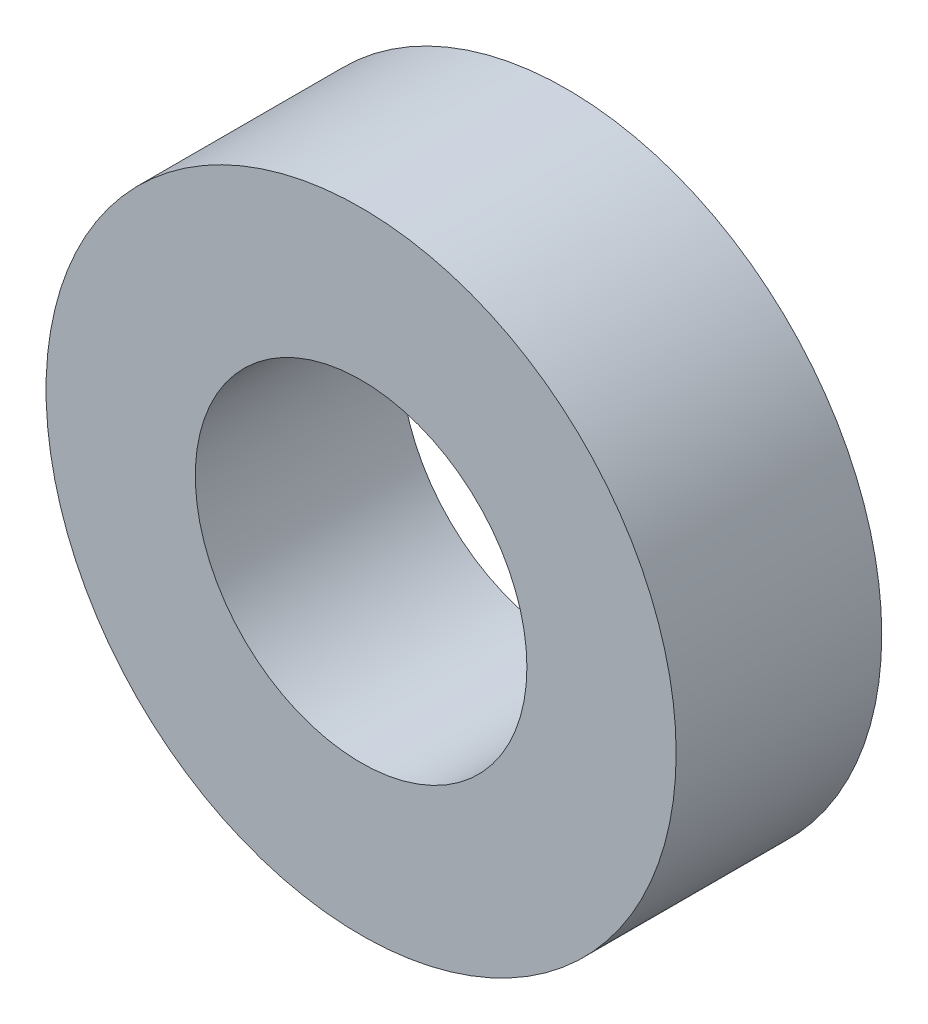
ISO-10303-21;
HEADER;
FILE_DESCRIPTION(('STEP AP214'),'2;1');
FILE_NAME('part.step','',(''),(''),'','','');
FILE_SCHEMA(('AUTOMOTIVE_DESIGN { 1 0 10303 214 1 1 1 1 }'));
ENDSEC;
DATA;
#1=APPLICATION_CONTEXT('core data for automotive mechanical design processes');
#2=APPLICATION_PROTOCOL_DEFINITION('international standard','automotive_design',2000,#1);
#3=PRODUCT_CONTEXT('',#1,'mechanical');
#4=PRODUCT('Part','Part','',(#3));
#5=PRODUCT_RELATED_PRODUCT_CATEGORY('part','',(#4));
#6=PRODUCT_DEFINITION_FORMATION('','',#4);
#7=PRODUCT_DEFINITION_CONTEXT('part definition',#1,'design');
#8=PRODUCT_DEFINITION('design','',#6,#7);
#9=PRODUCT_DEFINITION_SHAPE('','',#8);
#10=(LENGTH_UNIT() NAMED_UNIT(*) SI_UNIT(.MILLI.,.METRE.));
#11=(NAMED_UNIT(*) PLANE_ANGLE_UNIT() SI_UNIT($,.RADIAN.));
#12=(NAMED_UNIT(*) SI_UNIT($,.STERADIAN.) SOLID_ANGLE_UNIT());
#13=UNCERTAINTY_MEASURE_WITH_UNIT(LENGTH_MEASURE(1.E-05),#10,'distance_accuracy_value','');
#14=(GEOMETRIC_REPRESENTATION_CONTEXT(3) GLOBAL_UNCERTAINTY_ASSIGNED_CONTEXT((#13)) GLOBAL_UNIT_ASSIGNED_CONTEXT((#10,
#11,#12)) REPRESENTATION_CONTEXT('',''));
#15=CARTESIAN_POINT('',(0.,0.,0.));
#16=DIRECTION('',(0.,0.,1.));
#17=DIRECTION('',(1.,0.,0.));
#18=AXIS2_PLACEMENT_3D('',#15,#16,#17);
#19=CARTESIAN_POINT('',(0.,0.,-3.1));
#20=DIRECTION('',(0.,0.,1.));
#21=DIRECTION('',(1.,0.,0.));
#22=AXIS2_PLACEMENT_3D('',#19,#20,#21);
#23=CYLINDRICAL_SURFACE('',#22,4.75);
#24=CARTESIAN_POINT('',(0.,0.,-3.1));
#25=DIRECTION('',(0.,0.,1.));
#26=DIRECTION('',(1.,0.,0.));
#27=AXIS2_PLACEMENT_3D('',#24,#25,#26);
#28=CIRCLE('',#27,4.75);
#29=CARTESIAN_POINT('',(4.75,0.,-3.1));
#30=VERTEX_POINT('',#29);
#31=EDGE_CURVE('E10',#30,#30,#28,.T.);
#32=ORIENTED_EDGE('',*,*,#31,.T.);
#33=EDGE_LOOP('',(#32));
#34=FACE_BOUND('',#33,.T.);
#35=CARTESIAN_POINT('',(0.,0.,0.));
#36=DIRECTION('',(0.,0.,1.));
#37=DIRECTION('',(1.,0.,0.));
#38=AXIS2_PLACEMENT_3D('',#35,#36,#37);
#39=CIRCLE('',#38,4.75);
#40=CARTESIAN_POINT('',(4.75,0.,0.));
#41=VERTEX_POINT('',#40);
#42=EDGE_CURVE('E36',#41,#41,#39,.T.);
#43=ORIENTED_EDGE('',*,*,#42,.F.);
#44=EDGE_LOOP('',(#43));
#45=FACE_BOUND('',#44,.T.);
#46=ADVANCED_FACE('F33',(#34,#45),#23,.T.);
#47=CARTESIAN_POINT('',(0.,0.,-3.1));
#48=DIRECTION('',(0.,0.,1.));
#49=DIRECTION('',(1.,0.,0.));
#50=AXIS2_PLACEMENT_3D('',#47,#48,#49);
#51=PLANE('',#50);
#52=CARTESIAN_POINT('',(0.,0.,-3.1));
#53=DIRECTION('',(0.,0.,1.));
#54=DIRECTION('',(1.,0.,0.));
#55=AXIS2_PLACEMENT_3D('',#52,#53,#54);
#56=CIRCLE('',#55,2.5);
#57=CARTESIAN_POINT('',(2.5,0.,-3.1));
#58=VERTEX_POINT('',#57);
#59=EDGE_CURVE('E43',#58,#58,#56,.T.);
#60=ORIENTED_EDGE('',*,*,#59,.T.);
#61=EDGE_LOOP('',(#60));
#62=FACE_BOUND('',#61,.T.);
#63=ORIENTED_EDGE('',*,*,#31,.F.);
#64=EDGE_LOOP('',(#63));
#65=FACE_BOUND('',#64,.T.);
#66=ADVANCED_FACE('F51',(#62,#65),#51,.F.);
#67=CARTESIAN_POINT('',(0.,0.,0.));
#68=DIRECTION('',(0.,0.,1.));
#69=DIRECTION('',(1.,0.,0.));
#70=AXIS2_PLACEMENT_3D('',#67,#68,#69);
#71=PLANE('',#70);
#72=CARTESIAN_POINT('',(0.,0.,0.));
#73=DIRECTION('',(0.,0.,1.));
#74=DIRECTION('',(1.,0.,0.));
#75=AXIS2_PLACEMENT_3D('',#72,#73,#74);
#76=CIRCLE('',#75,2.5);
#77=CARTESIAN_POINT('',(2.5,0.,0.));
#78=VERTEX_POINT('',#77);
#79=EDGE_CURVE('E45',#78,#78,#76,.T.);
#80=ORIENTED_EDGE('',*,*,#79,.F.);
#81=EDGE_LOOP('',(#80));
#82=FACE_BOUND('',#81,.T.);
#83=ORIENTED_EDGE('',*,*,#42,.T.);
#84=EDGE_LOOP('',(#83));
#85=FACE_BOUND('',#84,.T.);
#86=ADVANCED_FACE('F57',(#82,#85),#71,.T.);
#87=CARTESIAN_POINT('',(0.,0.,-3.1));
#88=DIRECTION('',(0.,0.,1.));
#89=DIRECTION('',(1.,0.,0.));
#90=AXIS2_PLACEMENT_3D('',#87,#88,#89);
#91=CYLINDRICAL_SURFACE('',#90,2.5);
#92=ORIENTED_EDGE('',*,*,#59,.F.);
#93=EDGE_LOOP('',(#92));
#94=FACE_BOUND('',#93,.T.);
#95=ORIENTED_EDGE('',*,*,#79,.T.);
#96=EDGE_LOOP('',(#95));
#97=FACE_BOUND('',#96,.T.);
#98=ADVANCED_FACE('F54',(#94,#97),#91,.F.);
#99=CLOSED_SHELL('',(#46,#66,#86,#98));
#100=MANIFOLD_SOLID_BREP('B2',#99);
#101=ADVANCED_BREP_SHAPE_REPRESENTATION('',(#18,#100),#14);
#102=SHAPE_DEFINITION_REPRESENTATION(#9,#101);
ENDSEC;
END-ISO-10303-21;
